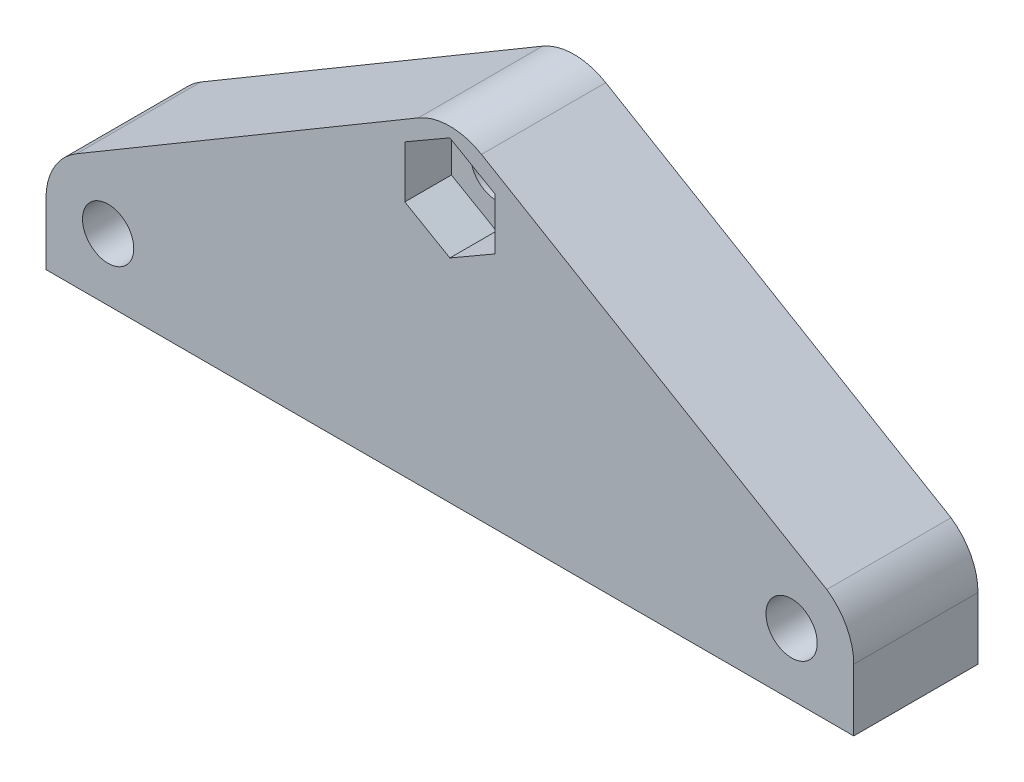
ISO-10303-21;
HEADER;
FILE_DESCRIPTION(('STEP AP214'),'2;1');
FILE_NAME('part.step','',(''),(''),'','','');
FILE_SCHEMA(('AUTOMOTIVE_DESIGN { 1 0 10303 214 1 1 1 1 }'));
ENDSEC;
DATA;
#1=APPLICATION_CONTEXT('core data for automotive mechanical design processes');
#2=APPLICATION_PROTOCOL_DEFINITION('international standard','automotive_design',2000,#1);
#3=PRODUCT_CONTEXT('',#1,'mechanical');
#4=PRODUCT('Part','Part','',(#3));
#5=PRODUCT_RELATED_PRODUCT_CATEGORY('part','',(#4));
#6=PRODUCT_DEFINITION_FORMATION('','',#4);
#7=PRODUCT_DEFINITION_CONTEXT('part definition',#1,'design');
#8=PRODUCT_DEFINITION('design','',#6,#7);
#9=PRODUCT_DEFINITION_SHAPE('','',#8);
#10=(LENGTH_UNIT() NAMED_UNIT(*) SI_UNIT(.MILLI.,.METRE.));
#11=(NAMED_UNIT(*) PLANE_ANGLE_UNIT() SI_UNIT($,.RADIAN.));
#12=(NAMED_UNIT(*) SI_UNIT($,.STERADIAN.) SOLID_ANGLE_UNIT());
#13=UNCERTAINTY_MEASURE_WITH_UNIT(LENGTH_MEASURE(1.E-05),#10,'distance_accuracy_value','');
#14=(GEOMETRIC_REPRESENTATION_CONTEXT(3) GLOBAL_UNCERTAINTY_ASSIGNED_CONTEXT((#13)) GLOBAL_UNIT_ASSIGNED_CONTEXT((#10,
#11,#12)) REPRESENTATION_CONTEXT('',''));
#15=CARTESIAN_POINT('',(0.,0.,0.));
#16=DIRECTION('',(0.,0.,1.));
#17=DIRECTION('',(1.,0.,0.));
#18=AXIS2_PLACEMENT_3D('',#15,#16,#17);
#19=CARTESIAN_POINT('',(26.,17.,8.));
#20=DIRECTION('',(0.,0.,-1.));
#21=DIRECTION('',(-1.,0.,0.));
#22=AXIS2_PLACEMENT_3D('',#19,#20,#21);
#23=CYLINDRICAL_SURFACE('',#22,1.65);
#24=CARTESIAN_POINT('',(26.,17.,0.));
#25=DIRECTION('',(0.,0.,1.));
#26=DIRECTION('',(1.,0.,0.));
#27=AXIS2_PLACEMENT_3D('',#24,#25,#26);
#28=CIRCLE('',#27,1.65);
#29=CARTESIAN_POINT('',(27.65,17.,0.));
#30=VERTEX_POINT('',#29);
#31=EDGE_CURVE('E146',#30,#30,#28,.T.);
#32=ORIENTED_EDGE('',*,*,#31,.F.);
#33=EDGE_LOOP('',(#32));
#34=FACE_BOUND('',#33,.T.);
#35=CARTESIAN_POINT('',(26.,17.,5.));
#36=DIRECTION('',(0.,0.,1.));
#37=DIRECTION('',(1.,0.,0.));
#38=AXIS2_PLACEMENT_3D('',#35,#36,#37);
#39=CIRCLE('',#38,1.65);
#40=CARTESIAN_POINT('',(27.65,17.,5.));
#41=VERTEX_POINT('',#40);
#42=EDGE_CURVE('E35',#41,#41,#39,.T.);
#43=ORIENTED_EDGE('',*,*,#42,.T.);
#44=EDGE_LOOP('',(#43));
#45=FACE_BOUND('',#44,.T.);
#46=ADVANCED_FACE('F31',(#34,#45),#23,.F.);
#47=CARTESIAN_POINT('',(4.,4.,8.));
#48=DIRECTION('',(0.,0.,1.));
#49=DIRECTION('',(1.,0.,0.));
#50=AXIS2_PLACEMENT_3D('',#47,#48,#49);
#51=PLANE('',#50);
#52=DIRECTION('',(0.866025403784439,-0.499999999999999,0.));
#53=VECTOR('',#52,1.);
#54=CARTESIAN_POINT('',(23.1,15.3256842193501,8.));
#55=LINE('',#54,#53);
#56=CARTESIAN_POINT('',(23.1,15.3256842193501,8.));
#57=VERTEX_POINT('',#56);
#58=CARTESIAN_POINT('',(26.,13.6513684387002,8.));
#59=VERTEX_POINT('',#58);
#60=EDGE_CURVE('E47',#57,#59,#55,.T.);
#61=ORIENTED_EDGE('',*,*,#60,.F.);
#62=DIRECTION('',(0.,-1.,0.));
#63=VECTOR('',#62,1.);
#64=CARTESIAN_POINT('',(23.1,18.6743157806499,8.));
#65=LINE('',#64,#63);
#66=CARTESIAN_POINT('',(23.1,18.6743157806499,8.));
#67=VERTEX_POINT('',#66);
#68=EDGE_CURVE('E224',#67,#57,#65,.T.);
#69=ORIENTED_EDGE('',*,*,#68,.F.);
#70=DIRECTION('',(-0.866025403784438,-0.5,0.));
#71=VECTOR('',#70,1.);
#72=CARTESIAN_POINT('',(26.,20.3486315612998,8.));
#73=LINE('',#72,#71);
#74=CARTESIAN_POINT('',(26.,20.3486315612998,8.));
#75=VERTEX_POINT('',#74);
#76=EDGE_CURVE('E228',#75,#67,#73,.T.);
#77=ORIENTED_EDGE('',*,*,#76,.F.);
#78=DIRECTION('',(-0.866025403784439,0.5,0.));
#79=VECTOR('',#78,1.);
#80=CARTESIAN_POINT('',(28.9,18.6743157806499,8.));
#81=LINE('',#80,#79);
#82=CARTESIAN_POINT('',(28.9,18.6743157806499,8.));
#83=VERTEX_POINT('',#82);
#84=EDGE_CURVE('E231',#83,#75,#81,.T.);
#85=ORIENTED_EDGE('',*,*,#84,.F.);
#86=DIRECTION('',(0.,1.,0.));
#87=VECTOR('',#86,1.);
#88=CARTESIAN_POINT('',(28.9,15.3256842193501,8.));
#89=LINE('',#88,#87);
#90=CARTESIAN_POINT('',(28.9,15.3256842193501,8.));
#91=VERTEX_POINT('',#90);
#92=EDGE_CURVE('E234',#91,#83,#89,.T.);
#93=ORIENTED_EDGE('',*,*,#92,.F.);
#94=DIRECTION('',(0.866025403784438,0.5,0.));
#95=VECTOR('',#94,1.);
#96=CARTESIAN_POINT('',(26.,13.6513684387002,8.));
#97=LINE('',#96,#95);
#98=EDGE_CURVE('E237',#59,#91,#97,.T.);
#99=ORIENTED_EDGE('',*,*,#98,.F.);
#100=EDGE_LOOP('',(#61,#69,#77,#85,#93,#99));
#101=FACE_BOUND('',#100,.T.);
#102=CARTESIAN_POINT('',(4.,4.,8.));
#103=DIRECTION('',(0.,0.,1.));
#104=DIRECTION('',(1.,0.,0.));
#105=AXIS2_PLACEMENT_3D('',#102,#103,#104);
#106=CIRCLE('',#105,1.65);
#107=CARTESIAN_POINT('',(5.65,4.,8.));
#108=VERTEX_POINT('',#107);
#109=EDGE_CURVE('E195',#108,#108,#106,.T.);
#110=ORIENTED_EDGE('',*,*,#109,.F.);
#111=EDGE_LOOP('',(#110));
#112=FACE_BOUND('',#111,.T.);
#113=DIRECTION('',(0.,-1.,0.));
#114=VECTOR('',#113,1.);
#115=CARTESIAN_POINT('',(0.,0.,8.));
#116=LINE('',#115,#114);
#117=CARTESIAN_POINT('',(0.,4.,8.));
#118=VERTEX_POINT('',#117);
#119=CARTESIAN_POINT('',(0.,0.,8.));
#120=VERTEX_POINT('',#119);
#121=EDGE_CURVE('E158',#118,#120,#116,.T.);
#122=ORIENTED_EDGE('',*,*,#121,.T.);
#123=DIRECTION('',(1.,0.,0.));
#124=VECTOR('',#123,1.);
#125=CARTESIAN_POINT('',(0.,0.,8.));
#126=LINE('',#125,#124);
#127=CARTESIAN_POINT('',(52.,0.,8.));
#128=VERTEX_POINT('',#127);
#129=EDGE_CURVE('E97',#120,#128,#126,.T.);
#130=ORIENTED_EDGE('',*,*,#129,.T.);
#131=DIRECTION('',(0.,1.,0.));
#132=VECTOR('',#131,1.);
#133=CARTESIAN_POINT('',(52.,0.,8.));
#134=LINE('',#133,#132);
#135=CARTESIAN_POINT('',(52.,4.,8.));
#136=VERTEX_POINT('',#135);
#137=EDGE_CURVE('E174',#128,#136,#134,.T.);
#138=ORIENTED_EDGE('',*,*,#137,.T.);
#139=CARTESIAN_POINT('',(48.,4.,8.));
#140=DIRECTION('',(0.,0.,1.));
#141=DIRECTION('',(1.,0.,0.));
#142=AXIS2_PLACEMENT_3D('',#139,#140,#141);
#143=CIRCLE('',#142,4.);
#144=CARTESIAN_POINT('',(50.2615852217613,7.29927753981243,8.));
#145=VERTEX_POINT('',#144);
#146=EDGE_CURVE('E187',#136,#145,#143,.T.);
#147=ORIENTED_EDGE('',*,*,#146,.T.);
#148=DIRECTION('',(-0.86074857551191,0.50903034266556,0.));
#149=VECTOR('',#148,1.);
#150=CARTESIAN_POINT('',(28.0361213706622,20.4429943020476,8.));
#151=LINE('',#150,#149);
#152=CARTESIAN_POINT('',(28.0361213706622,20.4429943020476,8.));
#153=VERTEX_POINT('',#152);
#154=EDGE_CURVE('E121',#145,#153,#151,.T.);
#155=ORIENTED_EDGE('',*,*,#154,.T.);
#156=CARTESIAN_POINT('',(26.,17.,8.));
#157=DIRECTION('',(0.,0.,1.));
#158=DIRECTION('',(1.,0.,0.));
#159=AXIS2_PLACEMENT_3D('',#156,#157,#158);
#160=CIRCLE('',#159,4.);
#161=CARTESIAN_POINT('',(23.9650827514934,20.4437061128573,8.));
#162=VERTEX_POINT('',#161);
#163=EDGE_CURVE('E113',#153,#162,#160,.T.);
#164=ORIENTED_EDGE('',*,*,#163,.T.);
#165=DIRECTION('',(-0.860926528214316,-0.508729312126641,0.));
#166=VECTOR('',#165,1.);
#167=CARTESIAN_POINT('',(23.9650827514934,20.4437061128573,8.));
#168=LINE('',#167,#166);
#169=CARTESIAN_POINT('',(1.96508275149344,7.44370611285727,8.));
#170=VERTEX_POINT('',#169);
#171=EDGE_CURVE('E118',#162,#170,#168,.T.);
#172=ORIENTED_EDGE('',*,*,#171,.T.);
#173=CARTESIAN_POINT('',(4.,4.,8.));
#174=DIRECTION('',(0.,0.,1.));
#175=DIRECTION('',(1.,0.,0.));
#176=AXIS2_PLACEMENT_3D('',#173,#174,#175);
#177=CIRCLE('',#176,4.00000000000001);
#178=EDGE_CURVE('E56',#170,#118,#177,.T.);
#179=ORIENTED_EDGE('',*,*,#178,.T.);
#180=EDGE_LOOP('',(#122,#130,#138,#147,#155,#164,#172,#179));
#181=FACE_BOUND('',#180,.T.);
#182=CARTESIAN_POINT('',(48.,4.,8.));
#183=DIRECTION('',(0.,0.,1.));
#184=DIRECTION('',(1.,0.,0.));
#185=AXIS2_PLACEMENT_3D('',#182,#183,#184);
#186=CIRCLE('',#185,1.65);
#187=CARTESIAN_POINT('',(49.65,4.,8.));
#188=VERTEX_POINT('',#187);
#189=EDGE_CURVE('E199',#188,#188,#186,.T.);
#190=ORIENTED_EDGE('',*,*,#189,.F.);
#191=EDGE_LOOP('',(#190));
#192=FACE_BOUND('',#191,.T.);
#193=ADVANCED_FACE('F115',(#101,#112,#181,#192),#51,.T.);
#194=CARTESIAN_POINT('',(4.,4.,0.));
#195=DIRECTION('',(0.,0.,1.));
#196=DIRECTION('',(1.,0.,0.));
#197=AXIS2_PLACEMENT_3D('',#194,#195,#196);
#198=PLANE('',#197);
#199=CARTESIAN_POINT('',(4.,4.,0.));
#200=DIRECTION('',(0.,0.,1.));
#201=DIRECTION('',(1.,0.,0.));
#202=AXIS2_PLACEMENT_3D('',#199,#200,#201);
#203=CIRCLE('',#202,1.65);
#204=CARTESIAN_POINT('',(5.65,4.,0.));
#205=VERTEX_POINT('',#204);
#206=EDGE_CURVE('E196',#205,#205,#203,.T.);
#207=ORIENTED_EDGE('',*,*,#206,.T.);
#208=EDGE_LOOP('',(#207));
#209=FACE_BOUND('',#208,.T.);
#210=DIRECTION('',(0.,-1.,0.));
#211=VECTOR('',#210,1.);
#212=CARTESIAN_POINT('',(0.,0.,0.));
#213=LINE('',#212,#211);
#214=CARTESIAN_POINT('',(0.,4.,0.));
#215=VERTEX_POINT('',#214);
#216=CARTESIAN_POINT('',(0.,0.,0.));
#217=VERTEX_POINT('',#216);
#218=EDGE_CURVE('E142',#215,#217,#213,.T.);
#219=ORIENTED_EDGE('',*,*,#218,.F.);
#220=CARTESIAN_POINT('',(4.,4.,0.));
#221=DIRECTION('',(0.,0.,1.));
#222=DIRECTION('',(1.,0.,0.));
#223=AXIS2_PLACEMENT_3D('',#220,#221,#222);
#224=CIRCLE('',#223,4.00000000000001);
#225=CARTESIAN_POINT('',(1.96508275149344,7.44370611285727,0.));
#226=VERTEX_POINT('',#225);
#227=EDGE_CURVE('E89',#226,#215,#224,.T.);
#228=ORIENTED_EDGE('',*,*,#227,.F.);
#229=DIRECTION('',(-0.860926528214316,-0.508729312126641,0.));
#230=VECTOR('',#229,1.);
#231=CARTESIAN_POINT('',(23.9650827514934,20.4437061128573,0.));
#232=LINE('',#231,#230);
#233=CARTESIAN_POINT('',(23.9650827514934,20.4437061128573,0.));
#234=VERTEX_POINT('',#233);
#235=EDGE_CURVE('E155',#234,#226,#232,.T.);
#236=ORIENTED_EDGE('',*,*,#235,.F.);
#237=CARTESIAN_POINT('',(26.,17.,0.));
#238=DIRECTION('',(0.,0.,1.));
#239=DIRECTION('',(1.,0.,0.));
#240=AXIS2_PLACEMENT_3D('',#237,#238,#239);
#241=CIRCLE('',#240,4.);
#242=CARTESIAN_POINT('',(28.0361213706622,20.4429943020476,0.));
#243=VERTEX_POINT('',#242);
#244=EDGE_CURVE('E130',#243,#234,#241,.T.);
#245=ORIENTED_EDGE('',*,*,#244,.F.);
#246=DIRECTION('',(-0.86074857551191,0.50903034266556,0.));
#247=VECTOR('',#246,1.);
#248=CARTESIAN_POINT('',(28.0361213706622,20.4429943020476,0.));
#249=LINE('',#248,#247);
#250=CARTESIAN_POINT('',(50.2615852217613,7.29927753981243,0.));
#251=VERTEX_POINT('',#250);
#252=EDGE_CURVE('E152',#251,#243,#249,.T.);
#253=ORIENTED_EDGE('',*,*,#252,.F.);
#254=CARTESIAN_POINT('',(48.,4.,0.));
#255=DIRECTION('',(0.,0.,1.));
#256=DIRECTION('',(1.,0.,0.));
#257=AXIS2_PLACEMENT_3D('',#254,#255,#256);
#258=CIRCLE('',#257,4.);
#259=CARTESIAN_POINT('',(52.,4.,0.));
#260=VERTEX_POINT('',#259);
#261=EDGE_CURVE('E150',#260,#251,#258,.T.);
#262=ORIENTED_EDGE('',*,*,#261,.F.);
#263=DIRECTION('',(0.,1.,0.));
#264=VECTOR('',#263,1.);
#265=CARTESIAN_POINT('',(52.,0.,0.));
#266=LINE('',#265,#264);
#267=CARTESIAN_POINT('',(52.,0.,0.));
#268=VERTEX_POINT('',#267);
#269=EDGE_CURVE('E148',#268,#260,#266,.T.);
#270=ORIENTED_EDGE('',*,*,#269,.F.);
#271=DIRECTION('',(1.,0.,0.));
#272=VECTOR('',#271,1.);
#273=CARTESIAN_POINT('',(0.,0.,0.));
#274=LINE('',#273,#272);
#275=EDGE_CURVE('E145',#217,#268,#274,.T.);
#276=ORIENTED_EDGE('',*,*,#275,.F.);
#277=EDGE_LOOP('',(#219,#228,#236,#245,#253,#262,#270,#276));
#278=FACE_BOUND('',#277,.T.);
#279=ORIENTED_EDGE('',*,*,#31,.T.);
#280=EDGE_LOOP('',(#279));
#281=FACE_BOUND('',#280,.T.);
#282=CARTESIAN_POINT('',(48.,4.,0.));
#283=DIRECTION('',(0.,0.,1.));
#284=DIRECTION('',(1.,0.,0.));
#285=AXIS2_PLACEMENT_3D('',#282,#283,#284);
#286=CIRCLE('',#285,1.65);
#287=CARTESIAN_POINT('',(49.65,4.,0.));
#288=VERTEX_POINT('',#287);
#289=EDGE_CURVE('E202',#288,#288,#286,.T.);
#290=ORIENTED_EDGE('',*,*,#289,.T.);
#291=EDGE_LOOP('',(#290));
#292=FACE_BOUND('',#291,.T.);
#293=ADVANCED_FACE('F178',(#209,#278,#281,#292),#198,.F.);
#294=CARTESIAN_POINT('',(0.,0.,8.));
#295=DIRECTION('',(1.,0.,0.));
#296=DIRECTION('',(0.,0.,-1.));
#297=AXIS2_PLACEMENT_3D('',#294,#295,#296);
#298=PLANE('',#297);
#299=ORIENTED_EDGE('',*,*,#218,.T.);
#300=DIRECTION('',(0.,0.,-1.));
#301=VECTOR('',#300,1.);
#302=CARTESIAN_POINT('',(0.,0.,8.));
#303=LINE('',#302,#301);
#304=EDGE_CURVE('E11',#120,#217,#303,.T.);
#305=ORIENTED_EDGE('',*,*,#304,.F.);
#306=ORIENTED_EDGE('',*,*,#121,.F.);
#307=DIRECTION('',(0.,0.,-1.));
#308=VECTOR('',#307,1.);
#309=CARTESIAN_POINT('',(0.,4.,8.));
#310=LINE('',#309,#308);
#311=EDGE_CURVE('E138',#118,#215,#310,.T.);
#312=ORIENTED_EDGE('',*,*,#311,.T.);
#313=EDGE_LOOP('',(#299,#305,#306,#312));
#314=FACE_BOUND('',#313,.T.);
#315=ADVANCED_FACE('F33',(#314),#298,.F.);
#316=CARTESIAN_POINT('',(0.,0.,8.));
#317=DIRECTION('',(0.,1.,0.));
#318=DIRECTION('',(0.,0.,1.));
#319=AXIS2_PLACEMENT_3D('',#316,#317,#318);
#320=PLANE('',#319);
#321=ORIENTED_EDGE('',*,*,#275,.T.);
#322=DIRECTION('',(0.,0.,-1.));
#323=VECTOR('',#322,1.);
#324=CARTESIAN_POINT('',(52.,0.,8.));
#325=LINE('',#324,#323);
#326=EDGE_CURVE('E40',#128,#268,#325,.T.);
#327=ORIENTED_EDGE('',*,*,#326,.F.);
#328=ORIENTED_EDGE('',*,*,#129,.F.);
#329=ORIENTED_EDGE('',*,*,#304,.T.);
#330=EDGE_LOOP('',(#321,#327,#328,#329));
#331=FACE_BOUND('',#330,.T.);
#332=ADVANCED_FACE('F341',(#331),#320,.F.);
#333=CARTESIAN_POINT('',(52.,0.,8.));
#334=DIRECTION('',(-1.,0.,0.));
#335=DIRECTION('',(0.,0.,1.));
#336=AXIS2_PLACEMENT_3D('',#333,#334,#335);
#337=PLANE('',#336);
#338=ORIENTED_EDGE('',*,*,#269,.T.);
#339=DIRECTION('',(0.,0.,-1.));
#340=VECTOR('',#339,1.);
#341=CARTESIAN_POINT('',(52.,4.,8.));
#342=LINE('',#341,#340);
#343=EDGE_CURVE('E165',#136,#260,#342,.T.);
#344=ORIENTED_EDGE('',*,*,#343,.F.);
#345=ORIENTED_EDGE('',*,*,#137,.F.);
#346=ORIENTED_EDGE('',*,*,#326,.T.);
#347=EDGE_LOOP('',(#338,#344,#345,#346));
#348=FACE_BOUND('',#347,.T.);
#349=ADVANCED_FACE('F172',(#348),#337,.F.);
#350=CARTESIAN_POINT('',(48.,4.,8.));
#351=DIRECTION('',(0.,0.,-1.));
#352=DIRECTION('',(-1.,0.,0.));
#353=AXIS2_PLACEMENT_3D('',#350,#351,#352);
#354=CYLINDRICAL_SURFACE('',#353,4.);
#355=ORIENTED_EDGE('',*,*,#261,.T.);
#356=DIRECTION('',(0.,0.,-1.));
#357=VECTOR('',#356,1.);
#358=CARTESIAN_POINT('',(50.2615852217613,7.29927753981243,8.));
#359=LINE('',#358,#357);
#360=EDGE_CURVE('E162',#145,#251,#359,.T.);
#361=ORIENTED_EDGE('',*,*,#360,.F.);
#362=ORIENTED_EDGE('',*,*,#146,.F.);
#363=ORIENTED_EDGE('',*,*,#343,.T.);
#364=EDGE_LOOP('',(#355,#361,#362,#363));
#365=FACE_BOUND('',#364,.T.);
#366=ADVANCED_FACE('F183',(#365),#354,.T.);
#367=CARTESIAN_POINT('',(28.0361213706622,20.4429943020476,8.));
#368=DIRECTION('',(-0.50903034266556,-0.86074857551191,0.));
#369=DIRECTION('',(0.860748575511911,-0.50903034266556,0.));
#370=AXIS2_PLACEMENT_3D('',#367,#368,#369);
#371=PLANE('',#370);
#372=ORIENTED_EDGE('',*,*,#252,.T.);
#373=DIRECTION('',(0.,0.,-1.));
#374=VECTOR('',#373,1.);
#375=CARTESIAN_POINT('',(28.0361213706622,20.4429943020476,8.));
#376=LINE('',#375,#374);
#377=EDGE_CURVE('E133',#153,#243,#376,.T.);
#378=ORIENTED_EDGE('',*,*,#377,.F.);
#379=ORIENTED_EDGE('',*,*,#154,.F.);
#380=ORIENTED_EDGE('',*,*,#360,.T.);
#381=EDGE_LOOP('',(#372,#378,#379,#380));
#382=FACE_BOUND('',#381,.T.);
#383=ADVANCED_FACE('F186',(#382),#371,.F.);
#384=CARTESIAN_POINT('',(26.,17.,8.));
#385=DIRECTION('',(0.,0.,-1.));
#386=DIRECTION('',(-1.,0.,0.));
#387=AXIS2_PLACEMENT_3D('',#384,#385,#386);
#388=CYLINDRICAL_SURFACE('',#387,4.);
#389=ORIENTED_EDGE('',*,*,#244,.T.);
#390=DIRECTION('',(0.,0.,-1.));
#391=VECTOR('',#390,1.);
#392=CARTESIAN_POINT('',(23.9650827514934,20.4437061128573,8.));
#393=LINE('',#392,#391);
#394=EDGE_CURVE('E127',#162,#234,#393,.T.);
#395=ORIENTED_EDGE('',*,*,#394,.F.);
#396=ORIENTED_EDGE('',*,*,#163,.F.);
#397=ORIENTED_EDGE('',*,*,#377,.T.);
#398=EDGE_LOOP('',(#389,#395,#396,#397));
#399=FACE_BOUND('',#398,.T.);
#400=ADVANCED_FACE('F128',(#399),#388,.T.);
#401=CARTESIAN_POINT('',(23.9650827514934,20.4437061128573,8.));
#402=DIRECTION('',(0.508729312126641,-0.860926528214315,0.));
#403=DIRECTION('',(0.860926528214316,0.508729312126641,0.));
#404=AXIS2_PLACEMENT_3D('',#401,#402,#403);
#405=PLANE('',#404);
#406=ORIENTED_EDGE('',*,*,#235,.T.);
#407=DIRECTION('',(0.,0.,-1.));
#408=VECTOR('',#407,1.);
#409=CARTESIAN_POINT('',(1.96508275149344,7.44370611285727,8.));
#410=LINE('',#409,#408);
#411=EDGE_CURVE('E134',#170,#226,#410,.T.);
#412=ORIENTED_EDGE('',*,*,#411,.F.);
#413=ORIENTED_EDGE('',*,*,#171,.F.);
#414=ORIENTED_EDGE('',*,*,#394,.T.);
#415=EDGE_LOOP('',(#406,#412,#413,#414));
#416=FACE_BOUND('',#415,.T.);
#417=ADVANCED_FACE('F136',(#416),#405,.F.);
#418=CARTESIAN_POINT('',(4.,4.,8.));
#419=DIRECTION('',(0.,0.,-1.));
#420=DIRECTION('',(-1.,0.,0.));
#421=AXIS2_PLACEMENT_3D('',#418,#419,#420);
#422=CYLINDRICAL_SURFACE('',#421,4.00000000000001);
#423=ORIENTED_EDGE('',*,*,#227,.T.);
#424=ORIENTED_EDGE('',*,*,#311,.F.);
#425=ORIENTED_EDGE('',*,*,#178,.F.);
#426=ORIENTED_EDGE('',*,*,#411,.T.);
#427=EDGE_LOOP('',(#423,#424,#425,#426));
#428=FACE_BOUND('',#427,.T.);
#429=ADVANCED_FACE('F329',(#428),#422,.T.);
#430=CARTESIAN_POINT('',(4.,4.,8.));
#431=DIRECTION('',(0.,0.,-1.));
#432=DIRECTION('',(-1.,0.,0.));
#433=AXIS2_PLACEMENT_3D('',#430,#431,#432);
#434=CYLINDRICAL_SURFACE('',#433,1.65);
#435=ORIENTED_EDGE('',*,*,#109,.T.);
#436=EDGE_LOOP('',(#435));
#437=FACE_BOUND('',#436,.T.);
#438=ORIENTED_EDGE('',*,*,#206,.F.);
#439=EDGE_LOOP('',(#438));
#440=FACE_BOUND('',#439,.T.);
#441=ADVANCED_FACE('F323',(#437,#440),#434,.F.);
#442=CARTESIAN_POINT('',(48.,4.,8.));
#443=DIRECTION('',(0.,0.,-1.));
#444=DIRECTION('',(-1.,0.,0.));
#445=AXIS2_PLACEMENT_3D('',#442,#443,#444);
#446=CYLINDRICAL_SURFACE('',#445,1.65);
#447=ORIENTED_EDGE('',*,*,#189,.T.);
#448=EDGE_LOOP('',(#447));
#449=FACE_BOUND('',#448,.T.);
#450=ORIENTED_EDGE('',*,*,#289,.F.);
#451=EDGE_LOOP('',(#450));
#452=FACE_BOUND('',#451,.T.);
#453=ADVANCED_FACE('F371',(#449,#452),#446,.F.);
#454=CARTESIAN_POINT('',(23.1,15.3256842193501,5.));
#455=DIRECTION('',(-0.499999999999999,-0.866025403784439,0.));
#456=DIRECTION('',(0.866025403784439,-0.499999999999999,0.));
#457=AXIS2_PLACEMENT_3D('',#454,#455,#456);
#458=PLANE('',#457);
#459=ORIENTED_EDGE('',*,*,#60,.T.);
#460=DIRECTION('',(0.,0.,1.));
#461=VECTOR('',#460,1.);
#462=CARTESIAN_POINT('',(26.,13.6513684387002,5.));
#463=LINE('',#462,#461);
#464=CARTESIAN_POINT('',(26.,13.6513684387002,5.));
#465=VERTEX_POINT('',#464);
#466=EDGE_CURVE('E207',#465,#59,#463,.T.);
#467=ORIENTED_EDGE('',*,*,#466,.F.);
#468=DIRECTION('',(0.866025403784439,-0.499999999999999,0.));
#469=VECTOR('',#468,1.);
#470=CARTESIAN_POINT('',(23.1,15.3256842193501,5.));
#471=LINE('',#470,#469);
#472=CARTESIAN_POINT('',(23.1,15.3256842193501,5.));
#473=VERTEX_POINT('',#472);
#474=EDGE_CURVE('E227',#473,#465,#471,.T.);
#475=ORIENTED_EDGE('',*,*,#474,.F.);
#476=DIRECTION('',(0.,0.,1.));
#477=VECTOR('',#476,1.);
#478=CARTESIAN_POINT('',(23.1,15.3256842193501,5.));
#479=LINE('',#478,#477);
#480=EDGE_CURVE('E222',#473,#57,#479,.T.);
#481=ORIENTED_EDGE('',*,*,#480,.T.);
#482=EDGE_LOOP('',(#459,#467,#475,#481));
#483=FACE_BOUND('',#482,.T.);
#484=ADVANCED_FACE('F264',(#483),#458,.F.);
#485=CARTESIAN_POINT('',(23.1,18.6743157806499,5.));
#486=DIRECTION('',(-1.,0.,0.));
#487=DIRECTION('',(0.,0.,1.));
#488=AXIS2_PLACEMENT_3D('',#485,#486,#487);
#489=PLANE('',#488);
#490=ORIENTED_EDGE('',*,*,#68,.T.);
#491=ORIENTED_EDGE('',*,*,#480,.F.);
#492=DIRECTION('',(0.,-1.,0.));
#493=VECTOR('',#492,1.);
#494=CARTESIAN_POINT('',(23.1,18.6743157806499,5.));
#495=LINE('',#494,#493);
#496=CARTESIAN_POINT('',(23.1,18.6743157806499,5.));
#497=VERTEX_POINT('',#496);
#498=EDGE_CURVE('E210',#497,#473,#495,.T.);
#499=ORIENTED_EDGE('',*,*,#498,.F.);
#500=DIRECTION('',(0.,0.,1.));
#501=VECTOR('',#500,1.);
#502=CARTESIAN_POINT('',(23.1,18.6743157806499,5.));
#503=LINE('',#502,#501);
#504=EDGE_CURVE('E219',#497,#67,#503,.T.);
#505=ORIENTED_EDGE('',*,*,#504,.T.);
#506=EDGE_LOOP('',(#490,#491,#499,#505));
#507=FACE_BOUND('',#506,.T.);
#508=ADVANCED_FACE('F280',(#507),#489,.F.);
#509=CARTESIAN_POINT('',(26.,20.3486315612998,5.));
#510=DIRECTION('',(-0.5,0.866025403784439,0.));
#511=DIRECTION('',(-0.866025403784439,-0.5,0.));
#512=AXIS2_PLACEMENT_3D('',#509,#510,#511);
#513=PLANE('',#512);
#514=ORIENTED_EDGE('',*,*,#76,.T.);
#515=ORIENTED_EDGE('',*,*,#504,.F.);
#516=DIRECTION('',(-0.866025403784438,-0.5,0.));
#517=VECTOR('',#516,1.);
#518=CARTESIAN_POINT('',(26.,20.3486315612998,5.));
#519=LINE('',#518,#517);
#520=CARTESIAN_POINT('',(26.,20.3486315612998,5.));
#521=VERTEX_POINT('',#520);
#522=EDGE_CURVE('E243',#521,#497,#519,.T.);
#523=ORIENTED_EDGE('',*,*,#522,.F.);
#524=DIRECTION('',(0.,0.,1.));
#525=VECTOR('',#524,1.);
#526=CARTESIAN_POINT('',(26.,20.3486315612998,5.));
#527=LINE('',#526,#525);
#528=EDGE_CURVE('E216',#521,#75,#527,.T.);
#529=ORIENTED_EDGE('',*,*,#528,.T.);
#530=EDGE_LOOP('',(#514,#515,#523,#529));
#531=FACE_BOUND('',#530,.T.);
#532=ADVANCED_FACE('F285',(#531),#513,.F.);
#533=CARTESIAN_POINT('',(28.9,18.6743157806499,5.));
#534=DIRECTION('',(0.5,0.866025403784439,0.));
#535=DIRECTION('',(-0.866025403784439,0.5,0.));
#536=AXIS2_PLACEMENT_3D('',#533,#534,#535);
#537=PLANE('',#536);
#538=ORIENTED_EDGE('',*,*,#84,.T.);
#539=ORIENTED_EDGE('',*,*,#528,.F.);
#540=DIRECTION('',(-0.866025403784439,0.5,0.));
#541=VECTOR('',#540,1.);
#542=CARTESIAN_POINT('',(28.9,18.6743157806499,5.));
#543=LINE('',#542,#541);
#544=CARTESIAN_POINT('',(28.9,18.6743157806499,5.));
#545=VERTEX_POINT('',#544);
#546=EDGE_CURVE('E246',#545,#521,#543,.T.);
#547=ORIENTED_EDGE('',*,*,#546,.F.);
#548=DIRECTION('',(0.,0.,1.));
#549=VECTOR('',#548,1.);
#550=CARTESIAN_POINT('',(28.9,18.6743157806499,5.));
#551=LINE('',#550,#549);
#552=EDGE_CURVE('E213',#545,#83,#551,.T.);
#553=ORIENTED_EDGE('',*,*,#552,.T.);
#554=EDGE_LOOP('',(#538,#539,#547,#553));
#555=FACE_BOUND('',#554,.T.);
#556=ADVANCED_FACE('F304',(#555),#537,.F.);
#557=CARTESIAN_POINT('',(28.9,15.3256842193501,5.));
#558=DIRECTION('',(1.,0.,0.));
#559=DIRECTION('',(0.,0.,-1.));
#560=AXIS2_PLACEMENT_3D('',#557,#558,#559);
#561=PLANE('',#560);
#562=ORIENTED_EDGE('',*,*,#92,.T.);
#563=ORIENTED_EDGE('',*,*,#552,.F.);
#564=DIRECTION('',(0.,1.,0.));
#565=VECTOR('',#564,1.);
#566=CARTESIAN_POINT('',(28.9,15.3256842193501,5.));
#567=LINE('',#566,#565);
#568=CARTESIAN_POINT('',(28.9,15.3256842193501,5.));
#569=VERTEX_POINT('',#568);
#570=EDGE_CURVE('E249',#569,#545,#567,.T.);
#571=ORIENTED_EDGE('',*,*,#570,.F.);
#572=DIRECTION('',(0.,0.,1.));
#573=VECTOR('',#572,1.);
#574=CARTESIAN_POINT('',(28.9,15.3256842193501,5.));
#575=LINE('',#574,#573);
#576=EDGE_CURVE('E209',#569,#91,#575,.T.);
#577=ORIENTED_EDGE('',*,*,#576,.T.);
#578=EDGE_LOOP('',(#562,#563,#571,#577));
#579=FACE_BOUND('',#578,.T.);
#580=ADVANCED_FACE('F300',(#579),#561,.F.);
#581=CARTESIAN_POINT('',(26.,13.6513684387002,5.));
#582=DIRECTION('',(0.5,-0.866025403784439,0.));
#583=DIRECTION('',(0.866025403784439,0.5,0.));
#584=AXIS2_PLACEMENT_3D('',#581,#582,#583);
#585=PLANE('',#584);
#586=ORIENTED_EDGE('',*,*,#98,.T.);
#587=ORIENTED_EDGE('',*,*,#576,.F.);
#588=DIRECTION('',(0.866025403784438,0.5,0.));
#589=VECTOR('',#588,1.);
#590=CARTESIAN_POINT('',(26.,13.6513684387002,5.));
#591=LINE('',#590,#589);
#592=EDGE_CURVE('E252',#465,#569,#591,.T.);
#593=ORIENTED_EDGE('',*,*,#592,.F.);
#594=ORIENTED_EDGE('',*,*,#466,.T.);
#595=EDGE_LOOP('',(#586,#587,#593,#594));
#596=FACE_BOUND('',#595,.T.);
#597=ADVANCED_FACE('F294',(#596),#585,.F.);
#598=CARTESIAN_POINT('',(26.,13.6513684387002,5.));
#599=DIRECTION('',(0.,0.,1.));
#600=DIRECTION('',(1.,0.,0.));
#601=AXIS2_PLACEMENT_3D('',#598,#599,#600);
#602=PLANE('',#601);
#603=ORIENTED_EDGE('',*,*,#42,.F.);
#604=EDGE_LOOP('',(#603));
#605=FACE_BOUND('',#604,.T.);
#606=ORIENTED_EDGE('',*,*,#474,.T.);
#607=ORIENTED_EDGE('',*,*,#592,.T.);
#608=ORIENTED_EDGE('',*,*,#570,.T.);
#609=ORIENTED_EDGE('',*,*,#546,.T.);
#610=ORIENTED_EDGE('',*,*,#522,.T.);
#611=ORIENTED_EDGE('',*,*,#498,.T.);
#612=EDGE_LOOP('',(#606,#607,#608,#609,#610,#611));
#613=FACE_BOUND('',#612,.T.);
#614=ADVANCED_FACE('F259',(#605,#613),#602,.T.);
#615=CLOSED_SHELL('',(#46,#193,#293,#315,#332,#349,#366,#383,#400,#417,#429,#441,#453,#484,#508,
#532,#556,#580,#597,#614));
#616=MANIFOLD_SOLID_BREP('B2',#615);
#617=ADVANCED_BREP_SHAPE_REPRESENTATION('',(#18,#616),#14);
#618=SHAPE_DEFINITION_REPRESENTATION(#9,#617);
ENDSEC;
END-ISO-10303-21;
